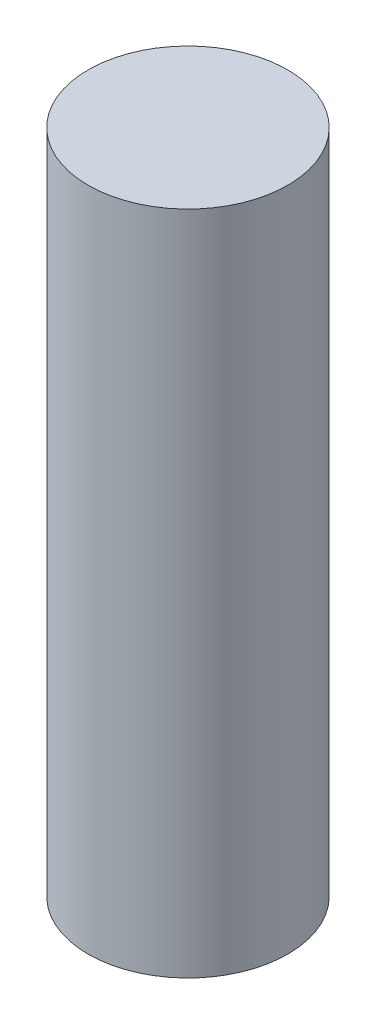
ISO-10303-21;
HEADER;
FILE_DESCRIPTION(('STEP AP214'),'2;1');
FILE_NAME('part.step','',(''),(''),'','','');
FILE_SCHEMA(('AUTOMOTIVE_DESIGN { 1 0 10303 214 1 1 1 1 }'));
ENDSEC;
DATA;
#1=APPLICATION_CONTEXT('core data for automotive mechanical design processes');
#2=APPLICATION_PROTOCOL_DEFINITION('international standard','automotive_design',2000,#1);
#3=PRODUCT_CONTEXT('',#1,'mechanical');
#4=PRODUCT('Part','Part','',(#3));
#5=PRODUCT_RELATED_PRODUCT_CATEGORY('part','',(#4));
#6=PRODUCT_DEFINITION_FORMATION('','',#4);
#7=PRODUCT_DEFINITION_CONTEXT('part definition',#1,'design');
#8=PRODUCT_DEFINITION('design','',#6,#7);
#9=PRODUCT_DEFINITION_SHAPE('','',#8);
#10=(LENGTH_UNIT() NAMED_UNIT(*) SI_UNIT(.MILLI.,.METRE.));
#11=(NAMED_UNIT(*) PLANE_ANGLE_UNIT() SI_UNIT($,.RADIAN.));
#12=(NAMED_UNIT(*) SI_UNIT($,.STERADIAN.) SOLID_ANGLE_UNIT());
#13=UNCERTAINTY_MEASURE_WITH_UNIT(LENGTH_MEASURE(1.E-05),#10,'distance_accuracy_value','');
#14=(GEOMETRIC_REPRESENTATION_CONTEXT(3) GLOBAL_UNCERTAINTY_ASSIGNED_CONTEXT((#13)) GLOBAL_UNIT_ASSIGNED_CONTEXT((#10,
#11,#12)) REPRESENTATION_CONTEXT('',''));
#15=CARTESIAN_POINT('',(0.,0.,0.));
#16=DIRECTION('',(0.,0.,1.));
#17=DIRECTION('',(1.,0.,0.));
#18=AXIS2_PLACEMENT_3D('',#15,#16,#17);
#19=CARTESIAN_POINT('',(0.,20.32,0.));
#20=DIRECTION('',(0.,-1.,0.));
#21=DIRECTION('',(0.,0.,-1.));
#22=AXIS2_PLACEMENT_3D('',#19,#20,#21);
#23=CYLINDRICAL_SURFACE('',#22,3.048);
#24=CARTESIAN_POINT('',(0.,20.32,0.));
#25=DIRECTION('',(0.,1.,0.));
#26=DIRECTION('',(0.,0.,1.));
#27=AXIS2_PLACEMENT_3D('',#24,#25,#26);
#28=CIRCLE('',#27,3.048);
#29=CARTESIAN_POINT('',(0.,20.32,3.048));
#30=VERTEX_POINT('',#29);
#31=EDGE_CURVE('E10',#30,#30,#28,.T.);
#32=ORIENTED_EDGE('',*,*,#31,.F.);
#33=EDGE_LOOP('',(#32));
#34=FACE_BOUND('',#33,.T.);
#35=CARTESIAN_POINT('',(0.,0.,0.));
#36=DIRECTION('',(0.,1.,0.));
#37=DIRECTION('',(0.,0.,1.));
#38=AXIS2_PLACEMENT_3D('',#35,#36,#37);
#39=CIRCLE('',#38,3.048);
#40=CARTESIAN_POINT('',(0.,0.,3.048));
#41=VERTEX_POINT('',#40);
#42=EDGE_CURVE('E42',#41,#41,#39,.T.);
#43=ORIENTED_EDGE('',*,*,#42,.T.);
#44=EDGE_LOOP('',(#43));
#45=FACE_BOUND('',#44,.T.);
#46=ADVANCED_FACE('F39',(#34,#45),#23,.T.);
#47=CARTESIAN_POINT('',(0.,20.32,0.));
#48=DIRECTION('',(0.,1.,0.));
#49=DIRECTION('',(0.,0.,1.));
#50=AXIS2_PLACEMENT_3D('',#47,#48,#49);
#51=PLANE('',#50);
#52=ORIENTED_EDGE('',*,*,#31,.T.);
#53=EDGE_LOOP('',(#52));
#54=FACE_BOUND('',#53,.T.);
#55=ADVANCED_FACE('F56',(#54),#51,.T.);
#56=CARTESIAN_POINT('',(0.,0.,0.));
#57=DIRECTION('',(0.,1.,0.));
#58=DIRECTION('',(0.,0.,1.));
#59=AXIS2_PLACEMENT_3D('',#56,#57,#58);
#60=PLANE('',#59);
#61=ORIENTED_EDGE('',*,*,#42,.F.);
#62=EDGE_LOOP('',(#61));
#63=FACE_BOUND('',#62,.T.);
#64=ADVANCED_FACE('F54',(#63),#60,.F.);
#65=CLOSED_SHELL('',(#46,#55,#64));
#66=MANIFOLD_SOLID_BREP('B2',#65);
#67=ADVANCED_BREP_SHAPE_REPRESENTATION('',(#18,#66),#14);
#68=SHAPE_DEFINITION_REPRESENTATION(#9,#67);
ENDSEC;
END-ISO-10303-21;
